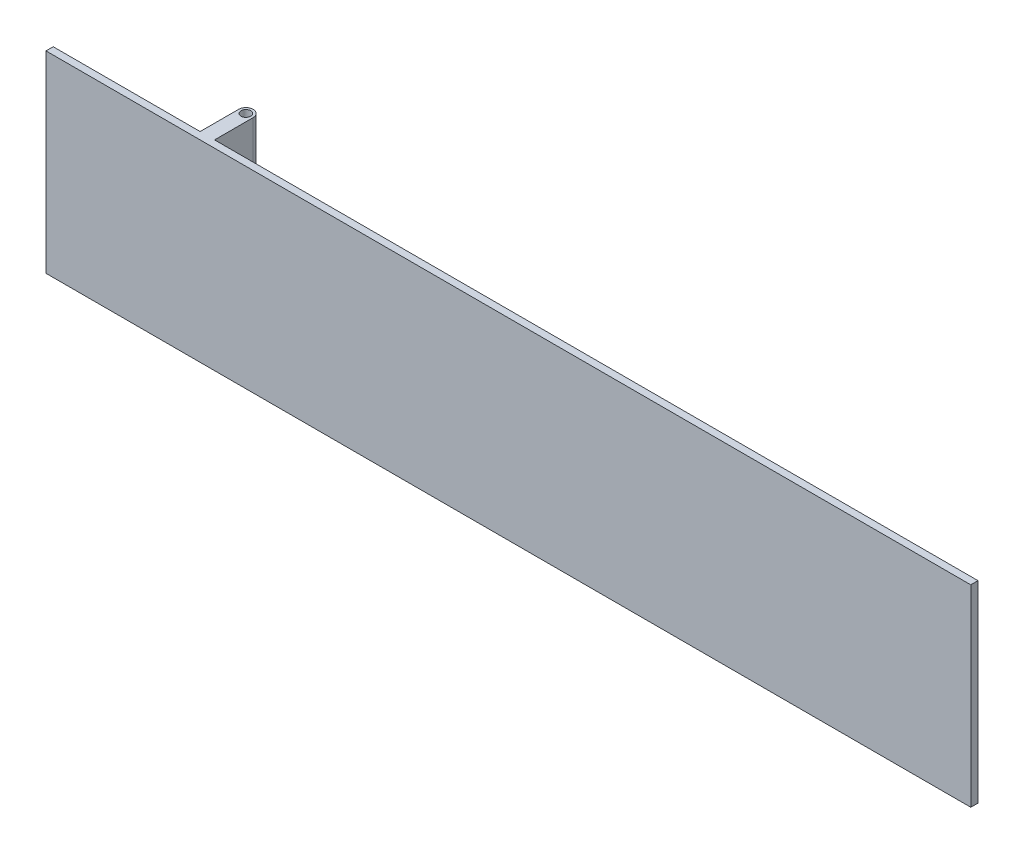
ISO-10303-21;
HEADER;
FILE_DESCRIPTION(('STEP AP214'),'2;1');
FILE_NAME('part.step','',(''),(''),'','','');
FILE_SCHEMA(('AUTOMOTIVE_DESIGN { 1 0 10303 214 1 1 1 1 }'));
ENDSEC;
DATA;
#1=APPLICATION_CONTEXT('core data for automotive mechanical design processes');
#2=APPLICATION_PROTOCOL_DEFINITION('international standard','automotive_design',2000,#1);
#3=PRODUCT_CONTEXT('',#1,'mechanical');
#4=PRODUCT('Part','Part','',(#3));
#5=PRODUCT_RELATED_PRODUCT_CATEGORY('part','',(#4));
#6=PRODUCT_DEFINITION_FORMATION('','',#4);
#7=PRODUCT_DEFINITION_CONTEXT('part definition',#1,'design');
#8=PRODUCT_DEFINITION('design','',#6,#7);
#9=PRODUCT_DEFINITION_SHAPE('','',#8);
#10=(LENGTH_UNIT() NAMED_UNIT(*) SI_UNIT(.MILLI.,.METRE.));
#11=(NAMED_UNIT(*) PLANE_ANGLE_UNIT() SI_UNIT($,.RADIAN.));
#12=(NAMED_UNIT(*) SI_UNIT($,.STERADIAN.) SOLID_ANGLE_UNIT());
#13=UNCERTAINTY_MEASURE_WITH_UNIT(LENGTH_MEASURE(1.E-05),#10,'distance_accuracy_value','');
#14=(GEOMETRIC_REPRESENTATION_CONTEXT(3) GLOBAL_UNCERTAINTY_ASSIGNED_CONTEXT((#13)) GLOBAL_UNIT_ASSIGNED_CONTEXT((#10,
#11,#12)) REPRESENTATION_CONTEXT('',''));
#15=CARTESIAN_POINT('',(0.,0.,0.));
#16=DIRECTION('',(0.,0.,1.));
#17=DIRECTION('',(1.,0.,0.));
#18=AXIS2_PLACEMENT_3D('',#15,#16,#17);
#19=CARTESIAN_POINT('',(-198.4375,63.5,-25.4));
#20=DIRECTION('',(-1.,0.,0.));
#21=DIRECTION('',(0.,0.,1.));
#22=AXIS2_PLACEMENT_3D('',#19,#20,#21);
#23=PLANE('',#22);
#24=DIRECTION('',(0.,-1.,0.));
#25=VECTOR('',#24,1.);
#26=CARTESIAN_POINT('',(-198.4375,63.5,0.));
#27=LINE('',#26,#25);
#28=CARTESIAN_POINT('',(-198.4375,63.5,0.));
#29=VERTEX_POINT('',#28);
#30=CARTESIAN_POINT('',(-198.4375,25.4,0.));
#31=VERTEX_POINT('',#30);
#32=EDGE_CURVE('E146',#29,#31,#27,.T.);
#33=ORIENTED_EDGE('',*,*,#32,.T.);
#34=DIRECTION('',(0.,0.,1.));
#35=VECTOR('',#34,1.);
#36=CARTESIAN_POINT('',(-198.4375,25.4,0.));
#37=LINE('',#36,#35);
#38=CARTESIAN_POINT('',(-198.4375,25.4,-25.4));
#39=VERTEX_POINT('',#38);
#40=EDGE_CURVE('E132',#39,#31,#37,.T.);
#41=ORIENTED_EDGE('',*,*,#40,.F.);
#42=DIRECTION('',(0.,-1.,0.));
#43=VECTOR('',#42,1.);
#44=CARTESIAN_POINT('',(-198.4375,63.5,-25.4));
#45=LINE('',#44,#43);
#46=CARTESIAN_POINT('',(-198.4375,63.5,-25.4));
#47=VERTEX_POINT('',#46);
#48=EDGE_CURVE('E147',#47,#39,#45,.T.);
#49=ORIENTED_EDGE('',*,*,#48,.F.);
#50=DIRECTION('',(0.,0.,-1.));
#51=VECTOR('',#50,1.);
#52=CARTESIAN_POINT('',(-198.4375,63.5,-25.4));
#53=LINE('',#52,#51);
#54=EDGE_CURVE('E206',#29,#47,#53,.T.);
#55=ORIENTED_EDGE('',*,*,#54,.F.);
#56=EDGE_LOOP('',(#33,#41,#49,#55));
#57=FACE_BOUND('',#56,.T.);
#58=ADVANCED_FACE('F35',(#57),#23,.F.);
#59=CARTESIAN_POINT('',(-203.2,63.5,-25.4));
#60=DIRECTION('',(0.,-1.,0.));
#61=DIRECTION('',(0.,0.,-1.));
#62=AXIS2_PLACEMENT_3D('',#59,#60,#61);
#63=CYLINDRICAL_SURFACE('',#62,4.7625);
#64=ORIENTED_EDGE('',*,*,#48,.T.);
#65=CARTESIAN_POINT('',(-203.2,25.4,-25.4));
#66=DIRECTION('',(0.,1.,0.));
#67=DIRECTION('',(0.,0.,1.));
#68=AXIS2_PLACEMENT_3D('',#65,#66,#67);
#69=CIRCLE('',#68,4.7625);
#70=CARTESIAN_POINT('',(-207.9625,25.4,-25.4));
#71=VERTEX_POINT('',#70);
#72=EDGE_CURVE('E197',#39,#71,#69,.T.);
#73=ORIENTED_EDGE('',*,*,#72,.T.);
#74=DIRECTION('',(0.,-1.,0.));
#75=VECTOR('',#74,1.);
#76=CARTESIAN_POINT('',(-207.9625,63.5,-25.4));
#77=LINE('',#76,#75);
#78=CARTESIAN_POINT('',(-207.9625,63.5,-25.4));
#79=VERTEX_POINT('',#78);
#80=EDGE_CURVE('E220',#79,#71,#77,.T.);
#81=ORIENTED_EDGE('',*,*,#80,.F.);
#82=CARTESIAN_POINT('',(-203.2,63.5,-25.4));
#83=DIRECTION('',(0.,1.,0.));
#84=DIRECTION('',(0.,0.,-1.));
#85=AXIS2_PLACEMENT_3D('',#82,#83,#84);
#86=CIRCLE('',#85,4.7625);
#87=EDGE_CURVE('E208',#47,#79,#86,.T.);
#88=ORIENTED_EDGE('',*,*,#87,.F.);
#89=EDGE_LOOP('',(#64,#73,#81,#88));
#90=FACE_BOUND('',#89,.T.);
#91=ADVANCED_FACE('F270',(#90),#63,.T.);
#92=CARTESIAN_POINT('',(-207.9625,63.5,0.));
#93=DIRECTION('',(1.,0.,0.));
#94=DIRECTION('',(0.,0.,-1.));
#95=AXIS2_PLACEMENT_3D('',#92,#93,#94);
#96=PLANE('',#95);
#97=ORIENTED_EDGE('',*,*,#80,.T.);
#98=DIRECTION('',(0.,0.,1.));
#99=VECTOR('',#98,1.);
#100=CARTESIAN_POINT('',(-207.9625,25.4,0.));
#101=LINE('',#100,#99);
#102=CARTESIAN_POINT('',(-207.9625,25.4,0.));
#103=VERTEX_POINT('',#102);
#104=EDGE_CURVE('E194',#71,#103,#101,.T.);
#105=ORIENTED_EDGE('',*,*,#104,.T.);
#106=DIRECTION('',(0.,-1.,0.));
#107=VECTOR('',#106,1.);
#108=CARTESIAN_POINT('',(-207.9625,63.5,0.));
#109=LINE('',#108,#107);
#110=CARTESIAN_POINT('',(-207.9625,63.5,0.));
#111=VERTEX_POINT('',#110);
#112=EDGE_CURVE('E218',#111,#103,#109,.T.);
#113=ORIENTED_EDGE('',*,*,#112,.F.);
#114=DIRECTION('',(0.,0.,1.));
#115=VECTOR('',#114,1.);
#116=CARTESIAN_POINT('',(-207.9625,63.5,0.));
#117=LINE('',#116,#115);
#118=EDGE_CURVE('E211',#79,#111,#117,.T.);
#119=ORIENTED_EDGE('',*,*,#118,.F.);
#120=EDGE_LOOP('',(#97,#105,#113,#119));
#121=FACE_BOUND('',#120,.T.);
#122=ADVANCED_FACE('F245',(#121),#96,.F.);
#123=CARTESIAN_POINT('',(-203.2,63.5,-25.4));
#124=DIRECTION('',(0.,-1.,0.));
#125=DIRECTION('',(0.,0.,-1.));
#126=AXIS2_PLACEMENT_3D('',#123,#124,#125);
#127=CYLINDRICAL_SURFACE('',#126,3.175);
#128=CARTESIAN_POINT('',(-203.2,25.4,-25.4));
#129=DIRECTION('',(0.,1.,0.));
#130=DIRECTION('',(0.,0.,1.));
#131=AXIS2_PLACEMENT_3D('',#128,#129,#130);
#132=CIRCLE('',#131,3.175);
#133=CARTESIAN_POINT('',(-203.2,25.4,-22.225));
#134=VERTEX_POINT('',#133);
#135=EDGE_CURVE('E39',#134,#134,#132,.T.);
#136=ORIENTED_EDGE('',*,*,#135,.F.);
#137=EDGE_LOOP('',(#136));
#138=FACE_BOUND('',#137,.T.);
#139=CARTESIAN_POINT('',(-203.2,63.5,-25.4));
#140=DIRECTION('',(0.,1.,0.));
#141=DIRECTION('',(0.,0.,1.));
#142=AXIS2_PLACEMENT_3D('',#139,#140,#141);
#143=CIRCLE('',#142,3.175);
#144=CARTESIAN_POINT('',(-203.2,63.5,-22.225));
#145=VERTEX_POINT('',#144);
#146=EDGE_CURVE('E200',#145,#145,#143,.T.);
#147=ORIENTED_EDGE('',*,*,#146,.T.);
#148=EDGE_LOOP('',(#147));
#149=FACE_BOUND('',#148,.T.);
#150=ADVANCED_FACE('F289',(#138,#149),#127,.F.);
#151=CARTESIAN_POINT('',(-304.8,-63.5,4.7625));
#152=DIRECTION('',(-1.,0.,0.));
#153=DIRECTION('',(0.,0.,1.));
#154=AXIS2_PLACEMENT_3D('',#151,#152,#153);
#155=PLANE('',#154);
#156=DIRECTION('',(0.,1.,0.));
#157=VECTOR('',#156,1.);
#158=CARTESIAN_POINT('',(-304.8,-63.5,0.));
#159=LINE('',#158,#157);
#160=CARTESIAN_POINT('',(-304.8,-63.5,0.));
#161=VERTEX_POINT('',#160);
#162=CARTESIAN_POINT('',(-304.8,63.5,0.));
#163=VERTEX_POINT('',#162);
#164=EDGE_CURVE('E150',#161,#163,#159,.T.);
#165=ORIENTED_EDGE('',*,*,#164,.F.);
#166=DIRECTION('',(0.,0.,-1.));
#167=VECTOR('',#166,1.);
#168=CARTESIAN_POINT('',(-304.8,-63.5,4.7625));
#169=LINE('',#168,#167);
#170=CARTESIAN_POINT('',(-304.8,-63.5,4.7625));
#171=VERTEX_POINT('',#170);
#172=EDGE_CURVE('E11',#171,#161,#169,.T.);
#173=ORIENTED_EDGE('',*,*,#172,.F.);
#174=DIRECTION('',(0.,1.,0.));
#175=VECTOR('',#174,1.);
#176=CARTESIAN_POINT('',(-304.8,-63.5,4.7625));
#177=LINE('',#176,#175);
#178=CARTESIAN_POINT('',(-304.8,63.5,4.7625));
#179=VERTEX_POINT('',#178);
#180=EDGE_CURVE('E155',#171,#179,#177,.T.);
#181=ORIENTED_EDGE('',*,*,#180,.T.);
#182=DIRECTION('',(0.,0.,-1.));
#183=VECTOR('',#182,1.);
#184=CARTESIAN_POINT('',(-304.8,63.5,4.7625));
#185=LINE('',#184,#183);
#186=EDGE_CURVE('E166',#179,#163,#185,.T.);
#187=ORIENTED_EDGE('',*,*,#186,.T.);
#188=EDGE_LOOP('',(#165,#173,#181,#187));
#189=FACE_BOUND('',#188,.T.);
#190=ADVANCED_FACE('F37',(#189),#155,.T.);
#191=CARTESIAN_POINT('',(-304.8,-63.5,4.7625));
#192=DIRECTION('',(0.,1.,0.));
#193=DIRECTION('',(0.,0.,1.));
#194=AXIS2_PLACEMENT_3D('',#191,#192,#193);
#195=PLANE('',#194);
#196=DIRECTION('',(1.,0.,0.));
#197=VECTOR('',#196,1.);
#198=CARTESIAN_POINT('',(-304.8,-63.5,0.));
#199=LINE('',#198,#197);
#200=CARTESIAN_POINT('',(-207.9625,-63.5,0.));
#201=VERTEX_POINT('',#200);
#202=EDGE_CURVE('E159',#161,#201,#199,.T.);
#203=ORIENTED_EDGE('',*,*,#202,.T.);
#204=DIRECTION('',(0.,0.,1.));
#205=VECTOR('',#204,1.);
#206=CARTESIAN_POINT('',(-207.9625,-63.5,0.));
#207=LINE('',#206,#205);
#208=CARTESIAN_POINT('',(-207.9625,-63.5,-25.4));
#209=VERTEX_POINT('',#208);
#210=EDGE_CURVE('E209',#209,#201,#207,.T.);
#211=ORIENTED_EDGE('',*,*,#210,.F.);
#212=CARTESIAN_POINT('',(-203.2,-63.5,-25.4));
#213=DIRECTION('',(0.,1.,0.));
#214=DIRECTION('',(0.,0.,-1.));
#215=AXIS2_PLACEMENT_3D('',#212,#213,#214);
#216=CIRCLE('',#215,4.7625);
#217=CARTESIAN_POINT('',(-198.4375,-63.5,-25.4));
#218=VERTEX_POINT('',#217);
#219=EDGE_CURVE('E214',#218,#209,#216,.T.);
#220=ORIENTED_EDGE('',*,*,#219,.F.);
#221=DIRECTION('',(0.,0.,-1.));
#222=VECTOR('',#221,1.);
#223=CARTESIAN_POINT('',(-198.4375,-63.5,-25.4));
#224=LINE('',#223,#222);
#225=CARTESIAN_POINT('',(-198.4375,-63.5,0.));
#226=VERTEX_POINT('',#225);
#227=EDGE_CURVE('E203',#226,#218,#224,.T.);
#228=ORIENTED_EDGE('',*,*,#227,.F.);
#229=CARTESIAN_POINT('',(304.8,-63.5,0.));
#230=VERTEX_POINT('',#229);
#231=EDGE_CURVE('E145',#226,#230,#199,.T.);
#232=ORIENTED_EDGE('',*,*,#231,.T.);
#233=DIRECTION('',(0.,0.,-1.));
#234=VECTOR('',#233,1.);
#235=CARTESIAN_POINT('',(304.8,-63.5,4.7625));
#236=LINE('',#235,#234);
#237=CARTESIAN_POINT('',(304.8,-63.5,4.7625));
#238=VERTEX_POINT('',#237);
#239=EDGE_CURVE('E44',#238,#230,#236,.T.);
#240=ORIENTED_EDGE('',*,*,#239,.F.);
#241=DIRECTION('',(1.,0.,0.));
#242=VECTOR('',#241,1.);
#243=CARTESIAN_POINT('',(-304.8,-63.5,4.7625));
#244=LINE('',#243,#242);
#245=EDGE_CURVE('E164',#171,#238,#244,.T.);
#246=ORIENTED_EDGE('',*,*,#245,.F.);
#247=ORIENTED_EDGE('',*,*,#172,.T.);
#248=EDGE_LOOP('',(#203,#211,#220,#228,#232,#240,#246,#247));
#249=FACE_BOUND('',#248,.T.);
#250=CARTESIAN_POINT('',(-203.2,-63.5,-25.4));
#251=DIRECTION('',(0.,1.,0.));
#252=DIRECTION('',(0.,0.,1.));
#253=AXIS2_PLACEMENT_3D('',#250,#251,#252);
#254=CIRCLE('',#253,3.175);
#255=CARTESIAN_POINT('',(-203.2,-63.5,-22.225));
#256=VERTEX_POINT('',#255);
#257=EDGE_CURVE('E199',#256,#256,#254,.T.);
#258=ORIENTED_EDGE('',*,*,#257,.T.);
#259=EDGE_LOOP('',(#258));
#260=FACE_BOUND('',#259,.T.);
#261=ADVANCED_FACE('F233',(#249,#260),#195,.F.);
#262=CARTESIAN_POINT('',(304.8,-63.5,4.7625));
#263=DIRECTION('',(-1.,0.,0.));
#264=DIRECTION('',(0.,0.,1.));
#265=AXIS2_PLACEMENT_3D('',#262,#263,#264);
#266=PLANE('',#265);
#267=DIRECTION('',(0.,1.,0.));
#268=VECTOR('',#267,1.);
#269=CARTESIAN_POINT('',(304.8,-63.5,0.));
#270=LINE('',#269,#268);
#271=CARTESIAN_POINT('',(304.8,63.5,0.));
#272=VERTEX_POINT('',#271);
#273=EDGE_CURVE('E172',#230,#272,#270,.T.);
#274=ORIENTED_EDGE('',*,*,#273,.T.);
#275=DIRECTION('',(0.,0.,-1.));
#276=VECTOR('',#275,1.);
#277=CARTESIAN_POINT('',(304.8,63.5,4.7625));
#278=LINE('',#277,#276);
#279=CARTESIAN_POINT('',(304.8,63.5,4.7625));
#280=VERTEX_POINT('',#279);
#281=EDGE_CURVE('E179',#280,#272,#278,.T.);
#282=ORIENTED_EDGE('',*,*,#281,.F.);
#283=DIRECTION('',(0.,1.,0.));
#284=VECTOR('',#283,1.);
#285=CARTESIAN_POINT('',(304.8,-63.5,4.7625));
#286=LINE('',#285,#284);
#287=EDGE_CURVE('E162',#238,#280,#286,.T.);
#288=ORIENTED_EDGE('',*,*,#287,.F.);
#289=ORIENTED_EDGE('',*,*,#239,.T.);
#290=EDGE_LOOP('',(#274,#282,#288,#289));
#291=FACE_BOUND('',#290,.T.);
#292=ADVANCED_FACE('F256',(#291),#266,.F.);
#293=CARTESIAN_POINT('',(-304.8,63.5,4.7625));
#294=DIRECTION('',(0.,1.,0.));
#295=DIRECTION('',(0.,0.,1.));
#296=AXIS2_PLACEMENT_3D('',#293,#294,#295);
#297=PLANE('',#296);
#298=DIRECTION('',(1.,0.,0.));
#299=VECTOR('',#298,1.);
#300=CARTESIAN_POINT('',(-304.8,63.5,0.));
#301=LINE('',#300,#299);
#302=EDGE_CURVE('E169',#163,#111,#301,.T.);
#303=ORIENTED_EDGE('',*,*,#302,.F.);
#304=ORIENTED_EDGE('',*,*,#186,.F.);
#305=DIRECTION('',(1.,0.,0.));
#306=VECTOR('',#305,1.);
#307=CARTESIAN_POINT('',(-304.8,63.5,4.7625));
#308=LINE('',#307,#306);
#309=EDGE_CURVE('E158',#179,#280,#308,.T.);
#310=ORIENTED_EDGE('',*,*,#309,.T.);
#311=ORIENTED_EDGE('',*,*,#281,.T.);
#312=EDGE_CURVE('E168',#29,#272,#301,.T.);
#313=ORIENTED_EDGE('',*,*,#312,.F.);
#314=ORIENTED_EDGE('',*,*,#54,.T.);
#315=ORIENTED_EDGE('',*,*,#87,.T.);
#316=ORIENTED_EDGE('',*,*,#118,.T.);
#317=EDGE_LOOP('',(#303,#304,#310,#311,#313,#314,#315,#316));
#318=FACE_BOUND('',#317,.T.);
#319=ORIENTED_EDGE('',*,*,#146,.F.);
#320=EDGE_LOOP('',(#319));
#321=FACE_BOUND('',#320,.T.);
#322=ADVANCED_FACE('F242',(#318,#321),#297,.T.);
#323=CARTESIAN_POINT('',(0.,0.,4.7625));
#324=DIRECTION('',(0.,0.,-1.));
#325=DIRECTION('',(-1.,0.,0.));
#326=AXIS2_PLACEMENT_3D('',#323,#324,#325);
#327=PLANE('',#326);
#328=ORIENTED_EDGE('',*,*,#180,.F.);
#329=ORIENTED_EDGE('',*,*,#245,.T.);
#330=ORIENTED_EDGE('',*,*,#287,.T.);
#331=ORIENTED_EDGE('',*,*,#309,.F.);
#332=EDGE_LOOP('',(#328,#329,#330,#331));
#333=FACE_BOUND('',#332,.T.);
#334=ADVANCED_FACE('F259',(#333),#327,.F.);
#335=CARTESIAN_POINT('',(0.,0.,0.));
#336=DIRECTION('',(0.,0.,-1.));
#337=DIRECTION('',(-1.,0.,0.));
#338=AXIS2_PLACEMENT_3D('',#335,#336,#337);
#339=PLANE('',#338);
#340=ORIENTED_EDGE('',*,*,#32,.F.);
#341=ORIENTED_EDGE('',*,*,#312,.T.);
#342=ORIENTED_EDGE('',*,*,#273,.F.);
#343=ORIENTED_EDGE('',*,*,#231,.F.);
#344=CARTESIAN_POINT('',(-198.4375,-25.4,0.));
#345=VERTEX_POINT('',#344);
#346=EDGE_CURVE('E137',#345,#226,#27,.T.);
#347=ORIENTED_EDGE('',*,*,#346,.F.);
#348=DIRECTION('',(1.,0.,0.));
#349=VECTOR('',#348,1.);
#350=CARTESIAN_POINT('',(-304.8,-25.4,0.));
#351=LINE('',#350,#349);
#352=CARTESIAN_POINT('',(-207.9625,-25.4,0.));
#353=VERTEX_POINT('',#352);
#354=EDGE_CURVE('E124',#353,#345,#351,.T.);
#355=ORIENTED_EDGE('',*,*,#354,.F.);
#356=EDGE_CURVE('E60',#353,#201,#109,.T.);
#357=ORIENTED_EDGE('',*,*,#356,.T.);
#358=ORIENTED_EDGE('',*,*,#202,.F.);
#359=ORIENTED_EDGE('',*,*,#164,.T.);
#360=ORIENTED_EDGE('',*,*,#302,.T.);
#361=ORIENTED_EDGE('',*,*,#112,.T.);
#362=DIRECTION('',(1.,0.,0.));
#363=VECTOR('',#362,1.);
#364=CARTESIAN_POINT('',(-304.8,25.4,0.));
#365=LINE('',#364,#363);
#366=EDGE_CURVE('E131',#103,#31,#365,.T.);
#367=ORIENTED_EDGE('',*,*,#366,.T.);
#368=EDGE_LOOP('',(#340,#341,#342,#343,#347,#355,#357,#358,#359,#360,#361,#367));
#369=FACE_BOUND('',#368,.T.);
#370=ADVANCED_FACE('F143',(#369),#339,.T.);
#371=CARTESIAN_POINT('',(-198.4375,-25.4,-25.4));
#372=VERTEX_POINT('',#371);
#373=EDGE_CURVE('E139',#372,#218,#45,.T.);
#374=ORIENTED_EDGE('',*,*,#373,.F.);
#375=DIRECTION('',(0.,0.,-1.));
#376=VECTOR('',#375,1.);
#377=CARTESIAN_POINT('',(-198.4375,-25.4,-30.1625));
#378=LINE('',#377,#376);
#379=EDGE_CURVE('E127',#345,#372,#378,.T.);
#380=ORIENTED_EDGE('',*,*,#379,.F.);
#381=ORIENTED_EDGE('',*,*,#346,.T.);
#382=ORIENTED_EDGE('',*,*,#227,.T.);
#383=EDGE_LOOP('',(#374,#380,#381,#382));
#384=FACE_BOUND('',#383,.T.);
#385=ADVANCED_FACE('F135',(#384),#23,.F.);
#386=CARTESIAN_POINT('',(-203.2,-25.4,-25.4));
#387=DIRECTION('',(0.,-1.,0.));
#388=DIRECTION('',(0.,0.,-1.));
#389=AXIS2_PLACEMENT_3D('',#386,#387,#388);
#390=CIRCLE('',#389,4.7625);
#391=CARTESIAN_POINT('',(-207.9625,-25.4,-25.4));
#392=VERTEX_POINT('',#391);
#393=EDGE_CURVE('E52',#392,#372,#390,.T.);
#394=ORIENTED_EDGE('',*,*,#393,.T.);
#395=ORIENTED_EDGE('',*,*,#373,.T.);
#396=ORIENTED_EDGE('',*,*,#219,.T.);
#397=EDGE_CURVE('E219',#392,#209,#77,.T.);
#398=ORIENTED_EDGE('',*,*,#397,.F.);
#399=EDGE_LOOP('',(#394,#395,#396,#398));
#400=FACE_BOUND('',#399,.T.);
#401=ADVANCED_FACE('F231',(#400),#63,.T.);
#402=ORIENTED_EDGE('',*,*,#356,.F.);
#403=DIRECTION('',(0.,0.,-1.));
#404=VECTOR('',#403,1.);
#405=CARTESIAN_POINT('',(-207.9625,-25.4,0.));
#406=LINE('',#405,#404);
#407=EDGE_CURVE('E129',#353,#392,#406,.T.);
#408=ORIENTED_EDGE('',*,*,#407,.T.);
#409=ORIENTED_EDGE('',*,*,#397,.T.);
#410=ORIENTED_EDGE('',*,*,#210,.T.);
#411=EDGE_LOOP('',(#402,#408,#409,#410));
#412=FACE_BOUND('',#411,.T.);
#413=ADVANCED_FACE('F227',(#412),#96,.F.);
#414=CARTESIAN_POINT('',(-203.2,-25.4,-25.4));
#415=DIRECTION('',(0.,-1.,0.));
#416=DIRECTION('',(0.,0.,-1.));
#417=AXIS2_PLACEMENT_3D('',#414,#415,#416);
#418=CIRCLE('',#417,3.175);
#419=CARTESIAN_POINT('',(-203.2,-25.4,-28.575));
#420=VERTEX_POINT('',#419);
#421=EDGE_CURVE('E183',#420,#420,#418,.T.);
#422=ORIENTED_EDGE('',*,*,#421,.F.);
#423=EDGE_LOOP('',(#422));
#424=FACE_BOUND('',#423,.T.);
#425=ORIENTED_EDGE('',*,*,#257,.F.);
#426=EDGE_LOOP('',(#425));
#427=FACE_BOUND('',#426,.T.);
#428=ADVANCED_FACE('F283',(#424,#427),#127,.F.);
#429=CARTESIAN_POINT('',(-304.8,25.4,0.));
#430=DIRECTION('',(0.,1.,0.));
#431=DIRECTION('',(0.,0.,1.));
#432=AXIS2_PLACEMENT_3D('',#429,#430,#431);
#433=PLANE('',#432);
#434=ORIENTED_EDGE('',*,*,#135,.T.);
#435=EDGE_LOOP('',(#434));
#436=FACE_BOUND('',#435,.T.);
#437=ORIENTED_EDGE('',*,*,#40,.T.);
#438=ORIENTED_EDGE('',*,*,#366,.F.);
#439=ORIENTED_EDGE('',*,*,#104,.F.);
#440=ORIENTED_EDGE('',*,*,#72,.F.);
#441=EDGE_LOOP('',(#437,#438,#439,#440));
#442=FACE_BOUND('',#441,.T.);
#443=ADVANCED_FACE('F248',(#436,#442),#433,.F.);
#444=CARTESIAN_POINT('',(-304.8,-25.4,-30.1625));
#445=DIRECTION('',(0.,-1.,0.));
#446=DIRECTION('',(0.,0.,-1.));
#447=AXIS2_PLACEMENT_3D('',#444,#445,#446);
#448=PLANE('',#447);
#449=ORIENTED_EDGE('',*,*,#421,.T.);
#450=EDGE_LOOP('',(#449));
#451=FACE_BOUND('',#450,.T.);
#452=ORIENTED_EDGE('',*,*,#393,.F.);
#453=ORIENTED_EDGE('',*,*,#407,.F.);
#454=ORIENTED_EDGE('',*,*,#354,.T.);
#455=ORIENTED_EDGE('',*,*,#379,.T.);
#456=EDGE_LOOP('',(#452,#453,#454,#455));
#457=FACE_BOUND('',#456,.T.);
#458=ADVANCED_FACE('F126',(#451,#457),#448,.F.);
#459=CLOSED_SHELL('',(#58,#91,#122,#150,#190,#261,#292,#322,#334,#370,#385,#401,#413,#428,#443,#458));
#460=MANIFOLD_SOLID_BREP('B2',#459);
#461=ADVANCED_BREP_SHAPE_REPRESENTATION('',(#18,#460),#14);
#462=SHAPE_DEFINITION_REPRESENTATION(#9,#461);
ENDSEC;
END-ISO-10303-21;
